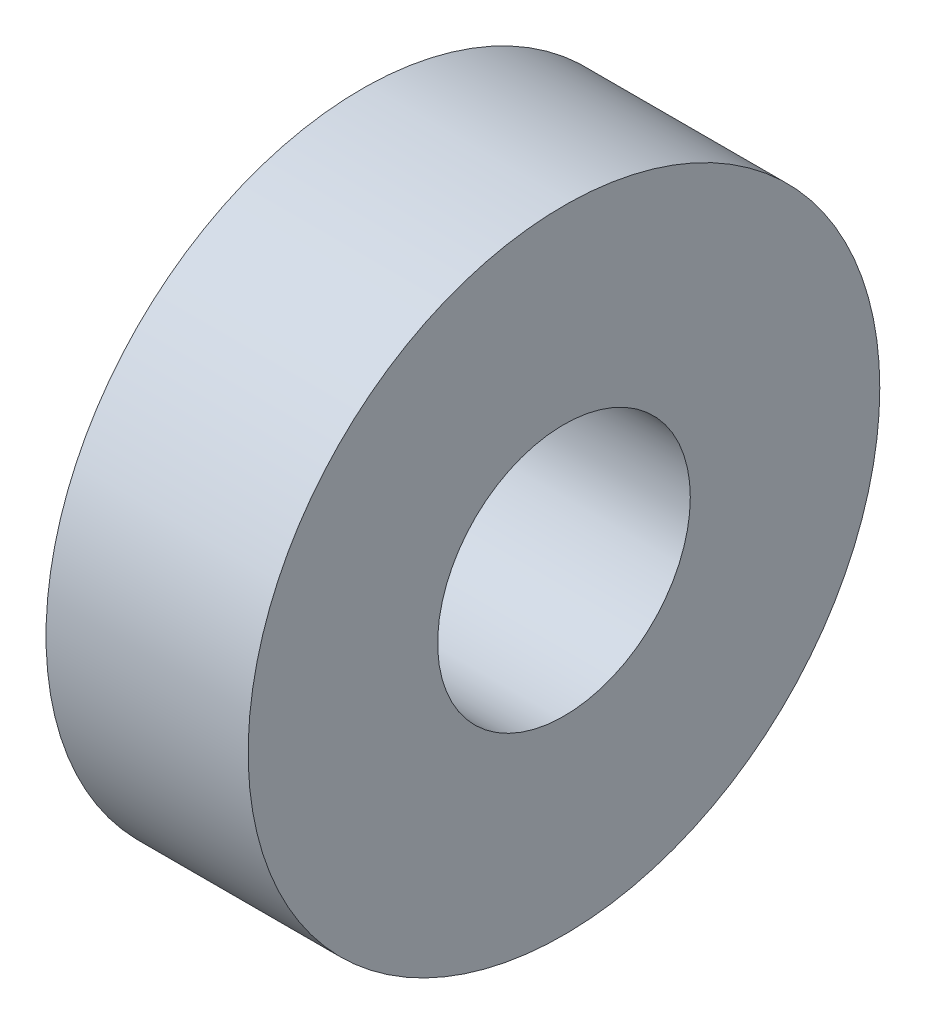
ISO-10303-21;
HEADER;
FILE_DESCRIPTION(('STEP AP214'),'2;1');
FILE_NAME('part.step','',(''),(''),'','','');
FILE_SCHEMA(('AUTOMOTIVE_DESIGN { 1 0 10303 214 1 1 1 1 }'));
ENDSEC;
DATA;
#1=APPLICATION_CONTEXT('core data for automotive mechanical design processes');
#2=APPLICATION_PROTOCOL_DEFINITION('international standard','automotive_design',2000,#1);
#3=PRODUCT_CONTEXT('',#1,'mechanical');
#4=PRODUCT('Part','Part','',(#3));
#5=PRODUCT_RELATED_PRODUCT_CATEGORY('part','',(#4));
#6=PRODUCT_DEFINITION_FORMATION('','',#4);
#7=PRODUCT_DEFINITION_CONTEXT('part definition',#1,'design');
#8=PRODUCT_DEFINITION('design','',#6,#7);
#9=PRODUCT_DEFINITION_SHAPE('','',#8);
#10=(LENGTH_UNIT() NAMED_UNIT(*) SI_UNIT(.MILLI.,.METRE.));
#11=(NAMED_UNIT(*) PLANE_ANGLE_UNIT() SI_UNIT($,.RADIAN.));
#12=(NAMED_UNIT(*) SI_UNIT($,.STERADIAN.) SOLID_ANGLE_UNIT());
#13=UNCERTAINTY_MEASURE_WITH_UNIT(LENGTH_MEASURE(1.E-05),#10,'distance_accuracy_value','');
#14=(GEOMETRIC_REPRESENTATION_CONTEXT(3) GLOBAL_UNCERTAINTY_ASSIGNED_CONTEXT((#13)) GLOBAL_UNIT_ASSIGNED_CONTEXT((#10,
#11,#12)) REPRESENTATION_CONTEXT('',''));
#15=CARTESIAN_POINT('',(0.,0.,0.));
#16=DIRECTION('',(0.,0.,1.));
#17=DIRECTION('',(1.,0.,0.));
#18=AXIS2_PLACEMENT_3D('',#15,#16,#17);
#19=CARTESIAN_POINT('',(5.08,0.,0.));
#20=DIRECTION('',(1.,0.,0.));
#21=DIRECTION('',(0.,0.,-1.));
#22=AXIS2_PLACEMENT_3D('',#19,#20,#21);
#23=PLANE('',#22);
#24=CARTESIAN_POINT('',(5.08,0.,0.));
#25=DIRECTION('',(1.,0.,0.));
#26=DIRECTION('',(0.,0.,-1.));
#27=AXIS2_PLACEMENT_3D('',#24,#25,#26);
#28=CIRCLE('',#27,7.9375);
#29=CARTESIAN_POINT('',(5.08,0.,-7.9375));
#30=VERTEX_POINT('',#29);
#31=EDGE_CURVE('E10',#30,#30,#28,.T.);
#32=ORIENTED_EDGE('',*,*,#31,.T.);
#33=EDGE_LOOP('',(#32));
#34=FACE_BOUND('',#33,.T.);
#35=CARTESIAN_POINT('',(5.08,0.,0.));
#36=DIRECTION('',(1.,0.,0.));
#37=DIRECTION('',(0.,0.,-1.));
#38=AXIS2_PLACEMENT_3D('',#35,#36,#37);
#39=CIRCLE('',#38,3.175);
#40=CARTESIAN_POINT('',(5.08,0.,-3.175));
#41=VERTEX_POINT('',#40);
#42=EDGE_CURVE('E42',#41,#41,#39,.T.);
#43=ORIENTED_EDGE('',*,*,#42,.F.);
#44=EDGE_LOOP('',(#43));
#45=FACE_BOUND('',#44,.T.);
#46=ADVANCED_FACE('F31',(#34,#45),#23,.T.);
#47=CARTESIAN_POINT('',(0.,0.,0.));
#48=DIRECTION('',(1.,0.,0.));
#49=DIRECTION('',(0.,0.,-1.));
#50=AXIS2_PLACEMENT_3D('',#47,#48,#49);
#51=PLANE('',#50);
#52=CARTESIAN_POINT('',(0.,0.,0.));
#53=DIRECTION('',(1.,0.,0.));
#54=DIRECTION('',(0.,0.,-1.));
#55=AXIS2_PLACEMENT_3D('',#52,#53,#54);
#56=CIRCLE('',#55,7.9375);
#57=CARTESIAN_POINT('',(0.,0.,-7.9375));
#58=VERTEX_POINT('',#57);
#59=EDGE_CURVE('E35',#58,#58,#56,.T.);
#60=ORIENTED_EDGE('',*,*,#59,.F.);
#61=EDGE_LOOP('',(#60));
#62=FACE_BOUND('',#61,.T.);
#63=CARTESIAN_POINT('',(0.,0.,0.));
#64=DIRECTION('',(1.,0.,0.));
#65=DIRECTION('',(0.,0.,-1.));
#66=AXIS2_PLACEMENT_3D('',#63,#64,#65);
#67=CIRCLE('',#66,3.175);
#68=CARTESIAN_POINT('',(0.,0.,-3.175));
#69=VERTEX_POINT('',#68);
#70=EDGE_CURVE('E44',#69,#69,#67,.T.);
#71=ORIENTED_EDGE('',*,*,#70,.T.);
#72=EDGE_LOOP('',(#71));
#73=FACE_BOUND('',#72,.T.);
#74=ADVANCED_FACE('F54',(#62,#73),#51,.F.);
#75=CARTESIAN_POINT('',(5.08,0.,0.));
#76=DIRECTION('',(-1.,0.,0.));
#77=DIRECTION('',(0.,0.,1.));
#78=AXIS2_PLACEMENT_3D('',#75,#76,#77);
#79=CYLINDRICAL_SURFACE('',#78,7.9375);
#80=ORIENTED_EDGE('',*,*,#31,.F.);
#81=EDGE_LOOP('',(#80));
#82=FACE_BOUND('',#81,.T.);
#83=ORIENTED_EDGE('',*,*,#59,.T.);
#84=EDGE_LOOP('',(#83));
#85=FACE_BOUND('',#84,.T.);
#86=ADVANCED_FACE('F33',(#82,#85),#79,.T.);
#87=CARTESIAN_POINT('',(5.08,0.,0.));
#88=DIRECTION('',(-1.,0.,0.));
#89=DIRECTION('',(0.,0.,1.));
#90=AXIS2_PLACEMENT_3D('',#87,#88,#89);
#91=CYLINDRICAL_SURFACE('',#90,3.175);
#92=ORIENTED_EDGE('',*,*,#42,.T.);
#93=EDGE_LOOP('',(#92));
#94=FACE_BOUND('',#93,.T.);
#95=ORIENTED_EDGE('',*,*,#70,.F.);
#96=EDGE_LOOP('',(#95));
#97=FACE_BOUND('',#96,.T.);
#98=ADVANCED_FACE('F50',(#94,#97),#91,.F.);
#99=CLOSED_SHELL('',(#46,#74,#86,#98));
#100=MANIFOLD_SOLID_BREP('B2',#99);
#101=ADVANCED_BREP_SHAPE_REPRESENTATION('',(#18,#100),#14);
#102=SHAPE_DEFINITION_REPRESENTATION(#9,#101);
ENDSEC;
END-ISO-10303-21;
